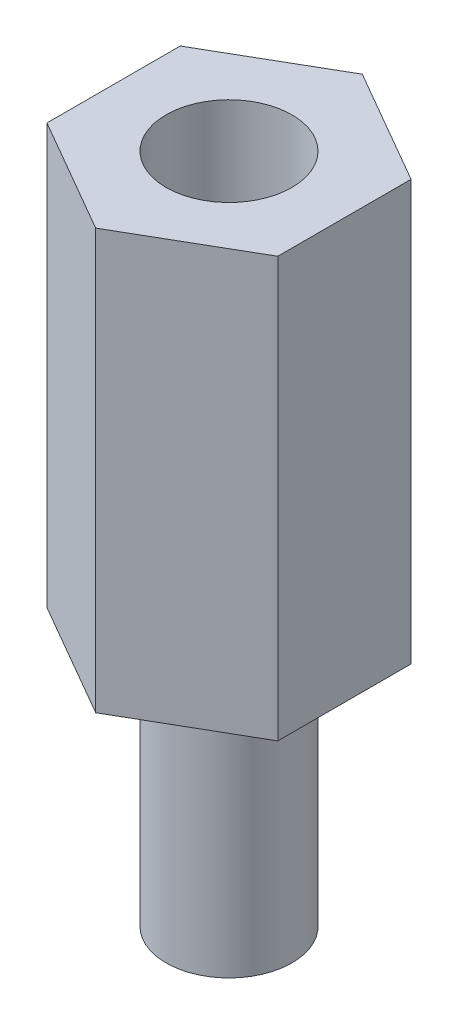
ISO-10303-21;
HEADER;
FILE_DESCRIPTION(('STEP AP214'),'2;1');
FILE_NAME('part.step','',(''),(''),'','','');
FILE_SCHEMA(('AUTOMOTIVE_DESIGN { 1 0 10303 214 1 1 1 1 }'));
ENDSEC;
DATA;
#1=APPLICATION_CONTEXT('core data for automotive mechanical design processes');
#2=APPLICATION_PROTOCOL_DEFINITION('international standard','automotive_design',2000,#1);
#3=PRODUCT_CONTEXT('',#1,'mechanical');
#4=PRODUCT('Part','Part','',(#3));
#5=PRODUCT_RELATED_PRODUCT_CATEGORY('part','',(#4));
#6=PRODUCT_DEFINITION_FORMATION('','',#4);
#7=PRODUCT_DEFINITION_CONTEXT('part definition',#1,'design');
#8=PRODUCT_DEFINITION('design','',#6,#7);
#9=PRODUCT_DEFINITION_SHAPE('','',#8);
#10=(LENGTH_UNIT() NAMED_UNIT(*) SI_UNIT(.MILLI.,.METRE.));
#11=(NAMED_UNIT(*) PLANE_ANGLE_UNIT() SI_UNIT($,.RADIAN.));
#12=(NAMED_UNIT(*) SI_UNIT($,.STERADIAN.) SOLID_ANGLE_UNIT());
#13=UNCERTAINTY_MEASURE_WITH_UNIT(LENGTH_MEASURE(1.E-05),#10,'distance_accuracy_value','');
#14=(GEOMETRIC_REPRESENTATION_CONTEXT(3) GLOBAL_UNCERTAINTY_ASSIGNED_CONTEXT((#13)) GLOBAL_UNIT_ASSIGNED_CONTEXT((#10,
#11,#12)) REPRESENTATION_CONTEXT('',''));
#15=CARTESIAN_POINT('',(0.,0.,0.));
#16=DIRECTION('',(0.,0.,1.));
#17=DIRECTION('',(1.,0.,0.));
#18=AXIS2_PLACEMENT_3D('',#15,#16,#17);
#19=CARTESIAN_POINT('',(2.74999999999998,10.,-1.5877132402715));
#20=DIRECTION('',(-0.499999999999995,0.,0.866025403784441));
#21=DIRECTION('',(0.866025403784441,0.,0.499999999999995));
#22=AXIS2_PLACEMENT_3D('',#19,#20,#21);
#23=PLANE('',#22);
#24=DIRECTION('',(-0.866025403784441,0.,-0.499999999999995));
#25=VECTOR('',#24,1.);
#26=CARTESIAN_POINT('',(2.74999999999998,0.,-1.5877132402715));
#27=LINE('',#26,#25);
#28=CARTESIAN_POINT('',(2.74999999999998,0.,-1.5877132402715));
#29=VERTEX_POINT('',#28);
#30=CARTESIAN_POINT('',(0.,0.,-3.17542648054294));
#31=VERTEX_POINT('',#30);
#32=EDGE_CURVE('E120',#29,#31,#27,.T.);
#33=ORIENTED_EDGE('',*,*,#32,.T.);
#34=DIRECTION('',(0.,-1.,0.));
#35=VECTOR('',#34,1.);
#36=CARTESIAN_POINT('',(0.,10.,-3.17542648054294));
#37=LINE('',#36,#35);
#38=CARTESIAN_POINT('',(0.,10.,-3.17542648054294));
#39=VERTEX_POINT('',#38);
#40=EDGE_CURVE('E37',#39,#31,#37,.T.);
#41=ORIENTED_EDGE('',*,*,#40,.F.);
#42=DIRECTION('',(-0.866025403784441,0.,-0.499999999999995));
#43=VECTOR('',#42,1.);
#44=CARTESIAN_POINT('',(2.74999999999998,10.,-1.5877132402715));
#45=LINE('',#44,#43);
#46=CARTESIAN_POINT('',(2.74999999999998,10.,-1.5877132402715));
#47=VERTEX_POINT('',#46);
#48=EDGE_CURVE('E131',#47,#39,#45,.T.);
#49=ORIENTED_EDGE('',*,*,#48,.F.);
#50=DIRECTION('',(0.,-1.,0.));
#51=VECTOR('',#50,1.);
#52=CARTESIAN_POINT('',(2.74999999999998,10.,-1.5877132402715));
#53=LINE('',#52,#51);
#54=EDGE_CURVE('E116',#47,#29,#53,.T.);
#55=ORIENTED_EDGE('',*,*,#54,.T.);
#56=EDGE_LOOP('',(#33,#41,#49,#55));
#57=FACE_BOUND('',#56,.T.);
#58=ADVANCED_FACE('F34',(#57),#23,.F.);
#59=CARTESIAN_POINT('',(0.,10.,-3.17542648054294));
#60=DIRECTION('',(0.500000000000001,0.,0.866025403784438));
#61=DIRECTION('',(0.866025403784438,0.,-0.500000000000001));
#62=AXIS2_PLACEMENT_3D('',#59,#60,#61);
#63=PLANE('',#62);
#64=DIRECTION('',(-0.866025403784438,0.,0.500000000000001));
#65=VECTOR('',#64,1.);
#66=CARTESIAN_POINT('',(0.,0.,-3.17542648054294));
#67=LINE('',#66,#65);
#68=CARTESIAN_POINT('',(-2.75,0.,-1.58771324027146));
#69=VERTEX_POINT('',#68);
#70=EDGE_CURVE('E123',#31,#69,#67,.T.);
#71=ORIENTED_EDGE('',*,*,#70,.T.);
#72=DIRECTION('',(0.,-1.,0.));
#73=VECTOR('',#72,1.);
#74=CARTESIAN_POINT('',(-2.75,10.,-1.58771324027146));
#75=LINE('',#74,#73);
#76=CARTESIAN_POINT('',(-2.75,10.,-1.58771324027146));
#77=VERTEX_POINT('',#76);
#78=EDGE_CURVE('E134',#77,#69,#75,.T.);
#79=ORIENTED_EDGE('',*,*,#78,.F.);
#80=DIRECTION('',(-0.866025403784438,0.,0.500000000000001));
#81=VECTOR('',#80,1.);
#82=CARTESIAN_POINT('',(0.,10.,-3.17542648054294));
#83=LINE('',#82,#81);
#84=EDGE_CURVE('E89',#39,#77,#83,.T.);
#85=ORIENTED_EDGE('',*,*,#84,.F.);
#86=ORIENTED_EDGE('',*,*,#40,.T.);
#87=EDGE_LOOP('',(#71,#79,#85,#86));
#88=FACE_BOUND('',#87,.T.);
#89=ADVANCED_FACE('F139',(#88),#63,.F.);
#90=CARTESIAN_POINT('',(-2.75,10.,-1.58771324027146));
#91=DIRECTION('',(1.,0.,0.));
#92=DIRECTION('',(0.,0.,-1.));
#93=AXIS2_PLACEMENT_3D('',#90,#91,#92);
#94=PLANE('',#93);
#95=DIRECTION('',(0.,0.,1.));
#96=VECTOR('',#95,1.);
#97=CARTESIAN_POINT('',(-2.75,0.,-1.58771324027146));
#98=LINE('',#97,#96);
#99=CARTESIAN_POINT('',(-2.74999999999999,0.,1.58771324027148));
#100=VERTEX_POINT('',#99);
#101=EDGE_CURVE('E126',#69,#100,#98,.T.);
#102=ORIENTED_EDGE('',*,*,#101,.T.);
#103=DIRECTION('',(0.,-1.,0.));
#104=VECTOR('',#103,1.);
#105=CARTESIAN_POINT('',(-2.74999999999999,10.,1.58771324027148));
#106=LINE('',#105,#104);
#107=CARTESIAN_POINT('',(-2.74999999999999,10.,1.58771324027148));
#108=VERTEX_POINT('',#107);
#109=EDGE_CURVE('E111',#108,#100,#106,.T.);
#110=ORIENTED_EDGE('',*,*,#109,.F.);
#111=DIRECTION('',(0.,0.,1.));
#112=VECTOR('',#111,1.);
#113=CARTESIAN_POINT('',(-2.75,10.,-1.58771324027146));
#114=LINE('',#113,#112);
#115=EDGE_CURVE('E102',#77,#108,#114,.T.);
#116=ORIENTED_EDGE('',*,*,#115,.F.);
#117=ORIENTED_EDGE('',*,*,#78,.T.);
#118=EDGE_LOOP('',(#102,#110,#116,#117));
#119=FACE_BOUND('',#118,.T.);
#120=ADVANCED_FACE('F145',(#119),#94,.F.);
#121=CARTESIAN_POINT('',(-2.74999999999999,10.,1.58771324027148));
#122=DIRECTION('',(0.499999999999995,0.,-0.866025403784442));
#123=DIRECTION('',(-0.866025403784442,0.,-0.499999999999995));
#124=AXIS2_PLACEMENT_3D('',#121,#122,#123);
#125=PLANE('',#124);
#126=DIRECTION('',(0.866025403784442,0.,0.499999999999995));
#127=VECTOR('',#126,1.);
#128=CARTESIAN_POINT('',(-2.74999999999999,0.,1.58771324027148));
#129=LINE('',#128,#127);
#130=CARTESIAN_POINT('',(0.,0.,3.17542648054294));
#131=VERTEX_POINT('',#130);
#132=EDGE_CURVE('E110',#100,#131,#129,.T.);
#133=ORIENTED_EDGE('',*,*,#132,.T.);
#134=DIRECTION('',(0.,-1.,0.));
#135=VECTOR('',#134,1.);
#136=CARTESIAN_POINT('',(0.,10.,3.17542648054294));
#137=LINE('',#136,#135);
#138=CARTESIAN_POINT('',(0.,10.,3.17542648054294));
#139=VERTEX_POINT('',#138);
#140=EDGE_CURVE('E107',#139,#131,#137,.T.);
#141=ORIENTED_EDGE('',*,*,#140,.F.);
#142=DIRECTION('',(0.866025403784442,0.,0.499999999999995));
#143=VECTOR('',#142,1.);
#144=CARTESIAN_POINT('',(-2.74999999999999,10.,1.58771324027148));
#145=LINE('',#144,#143);
#146=EDGE_CURVE('E96',#108,#139,#145,.T.);
#147=ORIENTED_EDGE('',*,*,#146,.F.);
#148=ORIENTED_EDGE('',*,*,#109,.T.);
#149=EDGE_LOOP('',(#133,#141,#147,#148));
#150=FACE_BOUND('',#149,.T.);
#151=ADVANCED_FACE('F108',(#150),#125,.F.);
#152=CARTESIAN_POINT('',(0.,10.,3.17542648054294));
#153=DIRECTION('',(-0.500000000000007,0.,-0.866025403784434));
#154=DIRECTION('',(-0.866025403784435,0.,0.500000000000007));
#155=AXIS2_PLACEMENT_3D('',#152,#153,#154);
#156=PLANE('',#155);
#157=DIRECTION('',(0.866025403784434,0.,-0.500000000000007));
#158=VECTOR('',#157,1.);
#159=CARTESIAN_POINT('',(0.,0.,3.17542648054294));
#160=LINE('',#159,#158);
#161=CARTESIAN_POINT('',(2.75000000000001,0.,1.58771324027144));
#162=VERTEX_POINT('',#161);
#163=EDGE_CURVE('E74',#131,#162,#160,.T.);
#164=ORIENTED_EDGE('',*,*,#163,.T.);
#165=DIRECTION('',(0.,-1.,0.));
#166=VECTOR('',#165,1.);
#167=CARTESIAN_POINT('',(2.75000000000001,10.,1.58771324027144));
#168=LINE('',#167,#166);
#169=CARTESIAN_POINT('',(2.75000000000001,10.,1.58771324027144));
#170=VERTEX_POINT('',#169);
#171=EDGE_CURVE('E112',#170,#162,#168,.T.);
#172=ORIENTED_EDGE('',*,*,#171,.F.);
#173=DIRECTION('',(0.866025403784434,0.,-0.500000000000007));
#174=VECTOR('',#173,1.);
#175=CARTESIAN_POINT('',(0.,10.,3.17542648054294));
#176=LINE('',#175,#174);
#177=EDGE_CURVE('E100',#139,#170,#176,.T.);
#178=ORIENTED_EDGE('',*,*,#177,.F.);
#179=ORIENTED_EDGE('',*,*,#140,.T.);
#180=EDGE_LOOP('',(#164,#172,#178,#179));
#181=FACE_BOUND('',#180,.T.);
#182=ADVANCED_FACE('F114',(#181),#156,.F.);
#183=CARTESIAN_POINT('',(2.75000000000001,10.,1.58771324027144));
#184=DIRECTION('',(-1.,0.,0.));
#185=DIRECTION('',(0.,0.,1.));
#186=AXIS2_PLACEMENT_3D('',#183,#184,#185);
#187=PLANE('',#186);
#188=DIRECTION('',(0.,0.,-1.));
#189=VECTOR('',#188,1.);
#190=CARTESIAN_POINT('',(2.75000000000001,0.,1.58771324027144));
#191=LINE('',#190,#189);
#192=EDGE_CURVE('E80',#162,#29,#191,.T.);
#193=ORIENTED_EDGE('',*,*,#192,.T.);
#194=ORIENTED_EDGE('',*,*,#54,.F.);
#195=DIRECTION('',(0.,0.,-1.));
#196=VECTOR('',#195,1.);
#197=CARTESIAN_POINT('',(2.75000000000001,10.,1.58771324027144));
#198=LINE('',#197,#196);
#199=EDGE_CURVE('E51',#170,#47,#198,.T.);
#200=ORIENTED_EDGE('',*,*,#199,.F.);
#201=ORIENTED_EDGE('',*,*,#171,.T.);
#202=EDGE_LOOP('',(#193,#194,#200,#201));
#203=FACE_BOUND('',#202,.T.);
#204=ADVANCED_FACE('F168',(#203),#187,.F.);
#205=CARTESIAN_POINT('',(0.,10.,0.));
#206=DIRECTION('',(0.,1.,0.));
#207=DIRECTION('',(0.,0.,1.));
#208=AXIS2_PLACEMENT_3D('',#205,#206,#207);
#209=PLANE('',#208);
#210=CARTESIAN_POINT('',(0.,10.,0.));
#211=DIRECTION('',(0.,1.,0.));
#212=DIRECTION('',(0.,0.,1.));
#213=AXIS2_PLACEMENT_3D('',#210,#211,#212);
#214=CIRCLE('',#213,1.5);
#215=CARTESIAN_POINT('',(0.,10.,1.5));
#216=VERTEX_POINT('',#215);
#217=EDGE_CURVE('E152',#216,#216,#214,.T.);
#218=ORIENTED_EDGE('',*,*,#217,.F.);
#219=EDGE_LOOP('',(#218));
#220=FACE_BOUND('',#219,.T.);
#221=ORIENTED_EDGE('',*,*,#48,.T.);
#222=ORIENTED_EDGE('',*,*,#84,.T.);
#223=ORIENTED_EDGE('',*,*,#115,.T.);
#224=ORIENTED_EDGE('',*,*,#146,.T.);
#225=ORIENTED_EDGE('',*,*,#177,.T.);
#226=ORIENTED_EDGE('',*,*,#199,.T.);
#227=EDGE_LOOP('',(#221,#222,#223,#224,#225,#226));
#228=FACE_BOUND('',#227,.T.);
#229=ADVANCED_FACE('F98',(#220,#228),#209,.T.);
#230=CARTESIAN_POINT('',(0.,0.,0.));
#231=DIRECTION('',(0.,1.,0.));
#232=DIRECTION('',(0.,0.,1.));
#233=AXIS2_PLACEMENT_3D('',#230,#231,#232);
#234=PLANE('',#233);
#235=CARTESIAN_POINT('',(0.,0.,0.));
#236=DIRECTION('',(0.,-1.,0.));
#237=DIRECTION('',(0.,0.,-1.));
#238=AXIS2_PLACEMENT_3D('',#235,#236,#237);
#239=CIRCLE('',#238,1.5);
#240=CARTESIAN_POINT('',(0.,0.,-1.5));
#241=VERTEX_POINT('',#240);
#242=EDGE_CURVE('E11',#241,#241,#239,.T.);
#243=ORIENTED_EDGE('',*,*,#242,.F.);
#244=EDGE_LOOP('',(#243));
#245=FACE_BOUND('',#244,.T.);
#246=ORIENTED_EDGE('',*,*,#32,.F.);
#247=ORIENTED_EDGE('',*,*,#192,.F.);
#248=ORIENTED_EDGE('',*,*,#163,.F.);
#249=ORIENTED_EDGE('',*,*,#132,.F.);
#250=ORIENTED_EDGE('',*,*,#101,.F.);
#251=ORIENTED_EDGE('',*,*,#70,.F.);
#252=EDGE_LOOP('',(#246,#247,#248,#249,#250,#251));
#253=FACE_BOUND('',#252,.T.);
#254=ADVANCED_FACE('F144',(#245,#253),#234,.F.);
#255=CARTESIAN_POINT('',(0.,-6.,0.));
#256=DIRECTION('',(0.,1.,0.));
#257=DIRECTION('',(0.,0.,1.));
#258=AXIS2_PLACEMENT_3D('',#255,#256,#257);
#259=CYLINDRICAL_SURFACE('',#258,1.5);
#260=CARTESIAN_POINT('',(0.,-6.,0.));
#261=DIRECTION('',(0.,-1.,0.));
#262=DIRECTION('',(0.,0.,-1.));
#263=AXIS2_PLACEMENT_3D('',#260,#261,#262);
#264=CIRCLE('',#263,1.5);
#265=CARTESIAN_POINT('',(0.,-6.,-1.5));
#266=VERTEX_POINT('',#265);
#267=EDGE_CURVE('E124',#266,#266,#264,.T.);
#268=ORIENTED_EDGE('',*,*,#267,.F.);
#269=EDGE_LOOP('',(#268));
#270=FACE_BOUND('',#269,.T.);
#271=ORIENTED_EDGE('',*,*,#242,.T.);
#272=EDGE_LOOP('',(#271));
#273=FACE_BOUND('',#272,.T.);
#274=ADVANCED_FACE('F174',(#270,#273),#259,.T.);
#275=CARTESIAN_POINT('',(0.,-6.,0.));
#276=DIRECTION('',(0.,-1.,0.));
#277=DIRECTION('',(0.,0.,-1.));
#278=AXIS2_PLACEMENT_3D('',#275,#276,#277);
#279=PLANE('',#278);
#280=ORIENTED_EDGE('',*,*,#267,.T.);
#281=EDGE_LOOP('',(#280));
#282=FACE_BOUND('',#281,.T.);
#283=ADVANCED_FACE('F163',(#282),#279,.T.);
#284=CARTESIAN_POINT('',(0.,4.,0.));
#285=DIRECTION('',(0.,1.,0.));
#286=DIRECTION('',(0.,0.,1.));
#287=AXIS2_PLACEMENT_3D('',#284,#285,#286);
#288=CYLINDRICAL_SURFACE('',#287,1.5);
#289=CARTESIAN_POINT('',(0.,4.,0.));
#290=DIRECTION('',(0.,1.,0.));
#291=DIRECTION('',(0.,0.,1.));
#292=AXIS2_PLACEMENT_3D('',#289,#290,#291);
#293=CIRCLE('',#292,1.5);
#294=CARTESIAN_POINT('',(0.,4.,1.5));
#295=VERTEX_POINT('',#294);
#296=EDGE_CURVE('E151',#295,#295,#293,.T.);
#297=ORIENTED_EDGE('',*,*,#296,.F.);
#298=EDGE_LOOP('',(#297));
#299=FACE_BOUND('',#298,.T.);
#300=ORIENTED_EDGE('',*,*,#217,.T.);
#301=EDGE_LOOP('',(#300));
#302=FACE_BOUND('',#301,.T.);
#303=ADVANCED_FACE('F160',(#299,#302),#288,.F.);
#304=CARTESIAN_POINT('',(0.,4.,0.));
#305=DIRECTION('',(0.,1.,0.));
#306=DIRECTION('',(0.,0.,1.));
#307=AXIS2_PLACEMENT_3D('',#304,#305,#306);
#308=PLANE('',#307);
#309=ORIENTED_EDGE('',*,*,#296,.T.);
#310=EDGE_LOOP('',(#309));
#311=FACE_BOUND('',#310,.T.);
#312=ADVANCED_FACE('F158',(#311),#308,.T.);
#313=CLOSED_SHELL('',(#58,#89,#120,#151,#182,#204,#229,#254,#274,#283,#303,#312));
#314=MANIFOLD_SOLID_BREP('B2',#313);
#315=ADVANCED_BREP_SHAPE_REPRESENTATION('',(#18,#314),#14);
#316=SHAPE_DEFINITION_REPRESENTATION(#9,#315);
ENDSEC;
END-ISO-10303-21;
